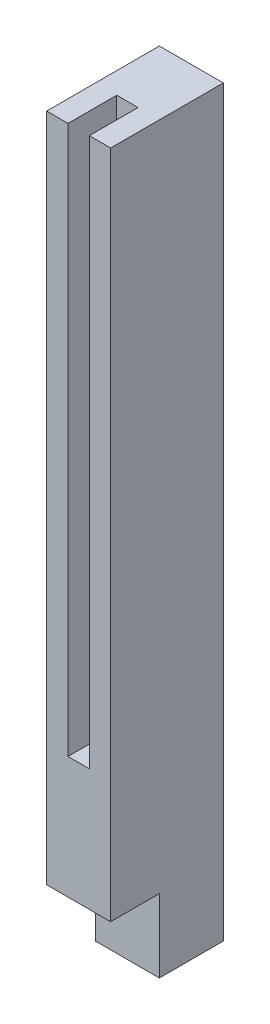
ISO-10303-21;
HEADER;
FILE_DESCRIPTION(('STEP AP214'),'2;1');
FILE_NAME('part.step','',(''),(''),'','','');
FILE_SCHEMA(('AUTOMOTIVE_DESIGN { 1 0 10303 214 1 1 1 1 }'));
ENDSEC;
DATA;
#1=APPLICATION_CONTEXT('core data for automotive mechanical design processes');
#2=APPLICATION_PROTOCOL_DEFINITION('international standard','automotive_design',2000,#1);
#3=PRODUCT_CONTEXT('',#1,'mechanical');
#4=PRODUCT('Part','Part','',(#3));
#5=PRODUCT_RELATED_PRODUCT_CATEGORY('part','',(#4));
#6=PRODUCT_DEFINITION_FORMATION('','',#4);
#7=PRODUCT_DEFINITION_CONTEXT('part definition',#1,'design');
#8=PRODUCT_DEFINITION('design','',#6,#7);
#9=PRODUCT_DEFINITION_SHAPE('','',#8);
#10=(LENGTH_UNIT() NAMED_UNIT(*) SI_UNIT(.MILLI.,.METRE.));
#11=(NAMED_UNIT(*) PLANE_ANGLE_UNIT() SI_UNIT($,.RADIAN.));
#12=(NAMED_UNIT(*) SI_UNIT($,.STERADIAN.) SOLID_ANGLE_UNIT());
#13=UNCERTAINTY_MEASURE_WITH_UNIT(LENGTH_MEASURE(1.E-05),#10,'distance_accuracy_value','');
#14=(GEOMETRIC_REPRESENTATION_CONTEXT(3) GLOBAL_UNCERTAINTY_ASSIGNED_CONTEXT((#13)) GLOBAL_UNIT_ASSIGNED_CONTEXT((#10,
#11,#12)) REPRESENTATION_CONTEXT('',''));
#15=CARTESIAN_POINT('',(0.,0.,0.));
#16=DIRECTION('',(0.,0.,1.));
#17=DIRECTION('',(1.,0.,0.));
#18=AXIS2_PLACEMENT_3D('',#15,#16,#17);
#19=CARTESIAN_POINT('',(2.62500000000001,6.,2.625));
#20=DIRECTION('',(-1.,0.,0.));
#21=DIRECTION('',(0.,0.,1.));
#22=AXIS2_PLACEMENT_3D('',#19,#20,#21);
#23=PLANE('',#22);
#24=DIRECTION('',(0.,0.,-1.));
#25=VECTOR('',#24,1.);
#26=CARTESIAN_POINT('',(2.62500000000001,0.,2.625));
#27=LINE('',#26,#25);
#28=CARTESIAN_POINT('',(2.62500000000001,0.,2.625));
#29=VERTEX_POINT('',#28);
#30=CARTESIAN_POINT('',(2.62500000000001,0.,-2.625));
#31=VERTEX_POINT('',#30);
#32=EDGE_CURVE('E95',#29,#31,#27,.T.);
#33=ORIENTED_EDGE('',*,*,#32,.T.);
#34=DIRECTION('',(0.,-1.,0.));
#35=VECTOR('',#34,1.);
#36=CARTESIAN_POINT('',(2.62500000000001,6.,-2.625));
#37=LINE('',#36,#35);
#38=CARTESIAN_POINT('',(2.62500000000001,61.,-2.625));
#39=VERTEX_POINT('',#38);
#40=EDGE_CURVE('E101',#39,#31,#37,.T.);
#41=ORIENTED_EDGE('',*,*,#40,.F.);
#42=DIRECTION('',(0.,0.,-1.));
#43=VECTOR('',#42,1.);
#44=CARTESIAN_POINT('',(2.62500000000001,61.,-2.625));
#45=LINE('',#44,#43);
#46=CARTESIAN_POINT('',(2.62500000000001,61.,6.625));
#47=VERTEX_POINT('',#46);
#48=EDGE_CURVE('E153',#47,#39,#45,.T.);
#49=ORIENTED_EDGE('',*,*,#48,.F.);
#50=DIRECTION('',(0.,-1.,0.));
#51=VECTOR('',#50,1.);
#52=CARTESIAN_POINT('',(2.62500000000001,61.,6.625));
#53=LINE('',#52,#51);
#54=CARTESIAN_POINT('',(2.62500000000001,6.,6.625));
#55=VERTEX_POINT('',#54);
#56=EDGE_CURVE('E151',#47,#55,#53,.T.);
#57=ORIENTED_EDGE('',*,*,#56,.T.);
#58=DIRECTION('',(0.,0.,-1.));
#59=VECTOR('',#58,1.);
#60=CARTESIAN_POINT('',(2.62500000000001,6.,-2.625));
#61=LINE('',#60,#59);
#62=CARTESIAN_POINT('',(2.62500000000001,6.,2.625));
#63=VERTEX_POINT('',#62);
#64=EDGE_CURVE('E111',#55,#63,#61,.T.);
#65=ORIENTED_EDGE('',*,*,#64,.T.);
#66=DIRECTION('',(0.,-1.,0.));
#67=VECTOR('',#66,1.);
#68=CARTESIAN_POINT('',(2.62500000000001,6.,2.625));
#69=LINE('',#68,#67);
#70=EDGE_CURVE('E90',#63,#29,#69,.T.);
#71=ORIENTED_EDGE('',*,*,#70,.T.);
#72=EDGE_LOOP('',(#33,#41,#49,#57,#65,#71));
#73=FACE_BOUND('',#72,.T.);
#74=ADVANCED_FACE('F34',(#73),#23,.F.);
#75=CARTESIAN_POINT('',(-2.62499999999999,6.,-2.625));
#76=DIRECTION('',(0.,0.,1.));
#77=DIRECTION('',(1.,0.,0.));
#78=AXIS2_PLACEMENT_3D('',#75,#76,#77);
#79=PLANE('',#78);
#80=DIRECTION('',(-1.,0.,0.));
#81=VECTOR('',#80,1.);
#82=CARTESIAN_POINT('',(-2.62499999999999,0.,-2.625));
#83=LINE('',#82,#81);
#84=CARTESIAN_POINT('',(-2.62499999999999,0.,-2.625));
#85=VERTEX_POINT('',#84);
#86=EDGE_CURVE('E81',#31,#85,#83,.T.);
#87=ORIENTED_EDGE('',*,*,#86,.T.);
#88=DIRECTION('',(0.,-1.,0.));
#89=VECTOR('',#88,1.);
#90=CARTESIAN_POINT('',(-2.62499999999999,6.,-2.625));
#91=LINE('',#90,#89);
#92=CARTESIAN_POINT('',(-2.62499999999999,61.,-2.625));
#93=VERTEX_POINT('',#92);
#94=EDGE_CURVE('E77',#93,#85,#91,.T.);
#95=ORIENTED_EDGE('',*,*,#94,.F.);
#96=DIRECTION('',(-1.,0.,0.));
#97=VECTOR('',#96,1.);
#98=CARTESIAN_POINT('',(-2.62499999999999,61.,-2.625));
#99=LINE('',#98,#97);
#100=EDGE_CURVE('E122',#39,#93,#99,.T.);
#101=ORIENTED_EDGE('',*,*,#100,.F.);
#102=ORIENTED_EDGE('',*,*,#40,.T.);
#103=EDGE_LOOP('',(#87,#95,#101,#102));
#104=FACE_BOUND('',#103,.T.);
#105=ADVANCED_FACE('F116',(#104),#79,.F.);
#106=CARTESIAN_POINT('',(-2.62499999999999,6.,2.625));
#107=DIRECTION('',(1.,0.,0.));
#108=DIRECTION('',(0.,0.,-1.));
#109=AXIS2_PLACEMENT_3D('',#106,#107,#108);
#110=PLANE('',#109);
#111=DIRECTION('',(0.,0.,1.));
#112=VECTOR('',#111,1.);
#113=CARTESIAN_POINT('',(-2.62499999999999,0.,2.625));
#114=LINE('',#113,#112);
#115=CARTESIAN_POINT('',(-2.62499999999999,0.,2.625));
#116=VERTEX_POINT('',#115);
#117=EDGE_CURVE('E73',#85,#116,#114,.T.);
#118=ORIENTED_EDGE('',*,*,#117,.T.);
#119=DIRECTION('',(0.,-1.,0.));
#120=VECTOR('',#119,1.);
#121=CARTESIAN_POINT('',(-2.62499999999999,6.,2.625));
#122=LINE('',#121,#120);
#123=CARTESIAN_POINT('',(-2.62499999999999,6.,2.625));
#124=VERTEX_POINT('',#123);
#125=EDGE_CURVE('E57',#124,#116,#122,.T.);
#126=ORIENTED_EDGE('',*,*,#125,.F.);
#127=DIRECTION('',(0.,0.,1.));
#128=VECTOR('',#127,1.);
#129=CARTESIAN_POINT('',(-2.62499999999999,6.,-2.625));
#130=LINE('',#129,#128);
#131=CARTESIAN_POINT('',(-2.62499999999999,6.,6.625));
#132=VERTEX_POINT('',#131);
#133=EDGE_CURVE('E133',#124,#132,#130,.T.);
#134=ORIENTED_EDGE('',*,*,#133,.T.);
#135=DIRECTION('',(0.,-1.,0.));
#136=VECTOR('',#135,1.);
#137=CARTESIAN_POINT('',(-2.62499999999999,61.,6.625));
#138=LINE('',#137,#136);
#139=CARTESIAN_POINT('',(-2.62499999999999,61.,6.625));
#140=VERTEX_POINT('',#139);
#141=EDGE_CURVE('E114',#140,#132,#138,.T.);
#142=ORIENTED_EDGE('',*,*,#141,.F.);
#143=DIRECTION('',(0.,0.,1.));
#144=VECTOR('',#143,1.);
#145=CARTESIAN_POINT('',(-2.62499999999999,61.,-2.625));
#146=LINE('',#145,#144);
#147=EDGE_CURVE('E162',#93,#140,#146,.T.);
#148=ORIENTED_EDGE('',*,*,#147,.F.);
#149=ORIENTED_EDGE('',*,*,#94,.T.);
#150=EDGE_LOOP('',(#118,#126,#134,#142,#148,#149));
#151=FACE_BOUND('',#150,.T.);
#152=ADVANCED_FACE('F74',(#151),#110,.F.);
#153=CARTESIAN_POINT('',(-2.62499999999999,6.,2.625));
#154=DIRECTION('',(0.,0.,-1.));
#155=DIRECTION('',(-1.,0.,0.));
#156=AXIS2_PLACEMENT_3D('',#153,#154,#155);
#157=PLANE('',#156);
#158=DIRECTION('',(1.,0.,0.));
#159=VECTOR('',#158,1.);
#160=CARTESIAN_POINT('',(-2.62499999999999,0.,2.625));
#161=LINE('',#160,#159);
#162=EDGE_CURVE('E80',#116,#29,#161,.T.);
#163=ORIENTED_EDGE('',*,*,#162,.T.);
#164=ORIENTED_EDGE('',*,*,#70,.F.);
#165=DIRECTION('',(1.,0.,0.));
#166=VECTOR('',#165,1.);
#167=CARTESIAN_POINT('',(-2.62499999999999,6.,2.625));
#168=LINE('',#167,#166);
#169=EDGE_CURVE('E88',#124,#63,#168,.T.);
#170=ORIENTED_EDGE('',*,*,#169,.F.);
#171=ORIENTED_EDGE('',*,*,#125,.T.);
#172=EDGE_LOOP('',(#163,#164,#170,#171));
#173=FACE_BOUND('',#172,.T.);
#174=ADVANCED_FACE('F84',(#173),#157,.F.);
#175=CARTESIAN_POINT('',(0.,0.,0.));
#176=DIRECTION('',(0.,-1.,0.));
#177=DIRECTION('',(0.,0.,-1.));
#178=AXIS2_PLACEMENT_3D('',#175,#176,#177);
#179=PLANE('',#178);
#180=ORIENTED_EDGE('',*,*,#32,.F.);
#181=ORIENTED_EDGE('',*,*,#162,.F.);
#182=ORIENTED_EDGE('',*,*,#117,.F.);
#183=ORIENTED_EDGE('',*,*,#86,.F.);
#184=EDGE_LOOP('',(#180,#181,#182,#183));
#185=FACE_BOUND('',#184,.T.);
#186=ADVANCED_FACE('F93',(#185),#179,.T.);
#187=CARTESIAN_POINT('',(0.,6.,0.));
#188=DIRECTION('',(0.,1.,0.));
#189=DIRECTION('',(0.,0.,1.));
#190=AXIS2_PLACEMENT_3D('',#187,#188,#189);
#191=PLANE('',#190);
#192=ORIENTED_EDGE('',*,*,#133,.F.);
#193=ORIENTED_EDGE('',*,*,#169,.T.);
#194=ORIENTED_EDGE('',*,*,#64,.F.);
#195=DIRECTION('',(1.,0.,0.));
#196=VECTOR('',#195,1.);
#197=CARTESIAN_POINT('',(-2.62499999999999,6.,6.625));
#198=LINE('',#197,#196);
#199=EDGE_CURVE('E136',#132,#55,#198,.T.);
#200=ORIENTED_EDGE('',*,*,#199,.F.);
#201=EDGE_LOOP('',(#192,#193,#194,#200));
#202=FACE_BOUND('',#201,.T.);
#203=ADVANCED_FACE('F130',(#202),#191,.F.);
#204=CARTESIAN_POINT('',(-2.62499999999999,61.,6.625));
#205=DIRECTION('',(0.,0.,-1.));
#206=DIRECTION('',(-1.,0.,0.));
#207=AXIS2_PLACEMENT_3D('',#204,#205,#206);
#208=PLANE('',#207);
#209=DIRECTION('',(1.,0.,0.));
#210=VECTOR('',#209,1.);
#211=CARTESIAN_POINT('',(-2.62499999999999,61.,6.625));
#212=LINE('',#211,#210);
#213=CARTESIAN_POINT('',(0.875,61.,6.625));
#214=VERTEX_POINT('',#213);
#215=EDGE_CURVE('E159',#214,#47,#212,.T.);
#216=ORIENTED_EDGE('',*,*,#215,.F.);
#217=DIRECTION('',(0.,-1.,0.));
#218=VECTOR('',#217,1.);
#219=CARTESIAN_POINT('',(0.875,61.,6.625));
#220=LINE('',#219,#218);
#221=CARTESIAN_POINT('',(0.875,16.,6.625));
#222=VERTEX_POINT('',#221);
#223=EDGE_CURVE('E139',#214,#222,#220,.T.);
#224=ORIENTED_EDGE('',*,*,#223,.T.);
#225=DIRECTION('',(-1.,0.,0.));
#226=VECTOR('',#225,1.);
#227=CARTESIAN_POINT('',(-2.62499999999999,16.,6.625));
#228=LINE('',#227,#226);
#229=CARTESIAN_POINT('',(-0.875,16.,6.625));
#230=VERTEX_POINT('',#229);
#231=EDGE_CURVE('E11',#222,#230,#228,.T.);
#232=ORIENTED_EDGE('',*,*,#231,.T.);
#233=DIRECTION('',(0.,1.,0.));
#234=VECTOR('',#233,1.);
#235=CARTESIAN_POINT('',(-0.875,61.,6.625));
#236=LINE('',#235,#234);
#237=CARTESIAN_POINT('',(-0.875,61.,6.625));
#238=VERTEX_POINT('',#237);
#239=EDGE_CURVE('E142',#230,#238,#236,.T.);
#240=ORIENTED_EDGE('',*,*,#239,.T.);
#241=EDGE_CURVE('E156',#140,#238,#212,.T.);
#242=ORIENTED_EDGE('',*,*,#241,.F.);
#243=ORIENTED_EDGE('',*,*,#141,.T.);
#244=ORIENTED_EDGE('',*,*,#199,.T.);
#245=ORIENTED_EDGE('',*,*,#56,.F.);
#246=EDGE_LOOP('',(#216,#224,#232,#240,#242,#243,#244,#245));
#247=FACE_BOUND('',#246,.T.);
#248=ADVANCED_FACE('F211',(#247),#208,.F.);
#249=CARTESIAN_POINT('',(0.,61.,0.));
#250=DIRECTION('',(0.,1.,0.));
#251=DIRECTION('',(0.,0.,1.));
#252=AXIS2_PLACEMENT_3D('',#249,#250,#251);
#253=PLANE('',#252);
#254=DIRECTION('',(0.,0.,-1.));
#255=VECTOR('',#254,1.);
#256=CARTESIAN_POINT('',(0.875000000000001,61.,0.));
#257=LINE('',#256,#255);
#258=CARTESIAN_POINT('',(0.875,61.,2.625));
#259=VERTEX_POINT('',#258);
#260=EDGE_CURVE('E41',#214,#259,#257,.T.);
#261=ORIENTED_EDGE('',*,*,#260,.F.);
#262=ORIENTED_EDGE('',*,*,#215,.T.);
#263=ORIENTED_EDGE('',*,*,#48,.T.);
#264=ORIENTED_EDGE('',*,*,#100,.T.);
#265=ORIENTED_EDGE('',*,*,#147,.T.);
#266=ORIENTED_EDGE('',*,*,#241,.T.);
#267=DIRECTION('',(0.,0.,1.));
#268=VECTOR('',#267,1.);
#269=CARTESIAN_POINT('',(-0.875,61.,10.625));
#270=LINE('',#269,#268);
#271=CARTESIAN_POINT('',(-0.875,61.,2.625));
#272=VERTEX_POINT('',#271);
#273=EDGE_CURVE('E171',#272,#238,#270,.T.);
#274=ORIENTED_EDGE('',*,*,#273,.F.);
#275=DIRECTION('',(-1.,0.,0.));
#276=VECTOR('',#275,1.);
#277=CARTESIAN_POINT('',(-0.875,61.,2.625));
#278=LINE('',#277,#276);
#279=EDGE_CURVE('E175',#259,#272,#278,.T.);
#280=ORIENTED_EDGE('',*,*,#279,.F.);
#281=EDGE_LOOP('',(#261,#262,#263,#264,#265,#266,#274,#280));
#282=FACE_BOUND('',#281,.T.);
#283=ADVANCED_FACE('F215',(#282),#253,.T.);
#284=CARTESIAN_POINT('',(0.,16.,0.));
#285=DIRECTION('',(0.,-1.,0.));
#286=DIRECTION('',(0.,0.,-1.));
#287=AXIS2_PLACEMENT_3D('',#284,#285,#286);
#288=PLANE('',#287);
#289=DIRECTION('',(0.,0.,-1.));
#290=VECTOR('',#289,1.);
#291=CARTESIAN_POINT('',(0.875,16.,10.625));
#292=LINE('',#291,#290);
#293=CARTESIAN_POINT('',(0.875,16.,2.625));
#294=VERTEX_POINT('',#293);
#295=EDGE_CURVE('E174',#222,#294,#292,.T.);
#296=ORIENTED_EDGE('',*,*,#295,.T.);
#297=DIRECTION('',(-1.,0.,0.));
#298=VECTOR('',#297,1.);
#299=CARTESIAN_POINT('',(-0.875,16.,2.625));
#300=LINE('',#299,#298);
#301=CARTESIAN_POINT('',(-0.875,16.,2.625));
#302=VERTEX_POINT('',#301);
#303=EDGE_CURVE('E179',#294,#302,#300,.T.);
#304=ORIENTED_EDGE('',*,*,#303,.T.);
#305=DIRECTION('',(0.,0.,1.));
#306=VECTOR('',#305,1.);
#307=CARTESIAN_POINT('',(-0.875,16.,10.625));
#308=LINE('',#307,#306);
#309=EDGE_CURVE('E168',#302,#230,#308,.T.);
#310=ORIENTED_EDGE('',*,*,#309,.T.);
#311=ORIENTED_EDGE('',*,*,#231,.F.);
#312=EDGE_LOOP('',(#296,#304,#310,#311));
#313=FACE_BOUND('',#312,.T.);
#314=ADVANCED_FACE('F187',(#313),#288,.F.);
#315=CARTESIAN_POINT('',(0.875,16.,10.625));
#316=DIRECTION('',(1.,0.,0.));
#317=DIRECTION('',(0.,0.,-1.));
#318=AXIS2_PLACEMENT_3D('',#315,#316,#317);
#319=PLANE('',#318);
#320=ORIENTED_EDGE('',*,*,#260,.T.);
#321=DIRECTION('',(0.,1.,0.));
#322=VECTOR('',#321,1.);
#323=CARTESIAN_POINT('',(0.875,16.,2.625));
#324=LINE('',#323,#322);
#325=EDGE_CURVE('E48',#294,#259,#324,.T.);
#326=ORIENTED_EDGE('',*,*,#325,.F.);
#327=ORIENTED_EDGE('',*,*,#295,.F.);
#328=ORIENTED_EDGE('',*,*,#223,.F.);
#329=EDGE_LOOP('',(#320,#326,#327,#328));
#330=FACE_BOUND('',#329,.T.);
#331=ADVANCED_FACE('F194',(#330),#319,.F.);
#332=CARTESIAN_POINT('',(-0.875,16.,10.625));
#333=DIRECTION('',(-1.,0.,0.));
#334=DIRECTION('',(0.,0.,1.));
#335=AXIS2_PLACEMENT_3D('',#332,#333,#334);
#336=PLANE('',#335);
#337=ORIENTED_EDGE('',*,*,#309,.F.);
#338=DIRECTION('',(0.,1.,0.));
#339=VECTOR('',#338,1.);
#340=CARTESIAN_POINT('',(-0.875,16.,2.625));
#341=LINE('',#340,#339);
#342=EDGE_CURVE('E166',#302,#272,#341,.T.);
#343=ORIENTED_EDGE('',*,*,#342,.T.);
#344=ORIENTED_EDGE('',*,*,#273,.T.);
#345=ORIENTED_EDGE('',*,*,#239,.F.);
#346=EDGE_LOOP('',(#337,#343,#344,#345));
#347=FACE_BOUND('',#346,.T.);
#348=ADVANCED_FACE('F205',(#347),#336,.F.);
#349=CARTESIAN_POINT('',(-0.875,16.,2.625));
#350=DIRECTION('',(0.,0.,-1.));
#351=DIRECTION('',(-1.,0.,0.));
#352=AXIS2_PLACEMENT_3D('',#349,#350,#351);
#353=PLANE('',#352);
#354=ORIENTED_EDGE('',*,*,#279,.T.);
#355=ORIENTED_EDGE('',*,*,#342,.F.);
#356=ORIENTED_EDGE('',*,*,#303,.F.);
#357=ORIENTED_EDGE('',*,*,#325,.T.);
#358=EDGE_LOOP('',(#354,#355,#356,#357));
#359=FACE_BOUND('',#358,.T.);
#360=ADVANCED_FACE('F198',(#359),#353,.F.);
#361=CLOSED_SHELL('',(#74,#105,#152,#174,#186,#203,#248,#283,#314,#331,#348,#360));
#362=MANIFOLD_SOLID_BREP('B2',#361);
#363=ADVANCED_BREP_SHAPE_REPRESENTATION('',(#18,#362),#14);
#364=SHAPE_DEFINITION_REPRESENTATION(#9,#363);
ENDSEC;
END-ISO-10303-21;
